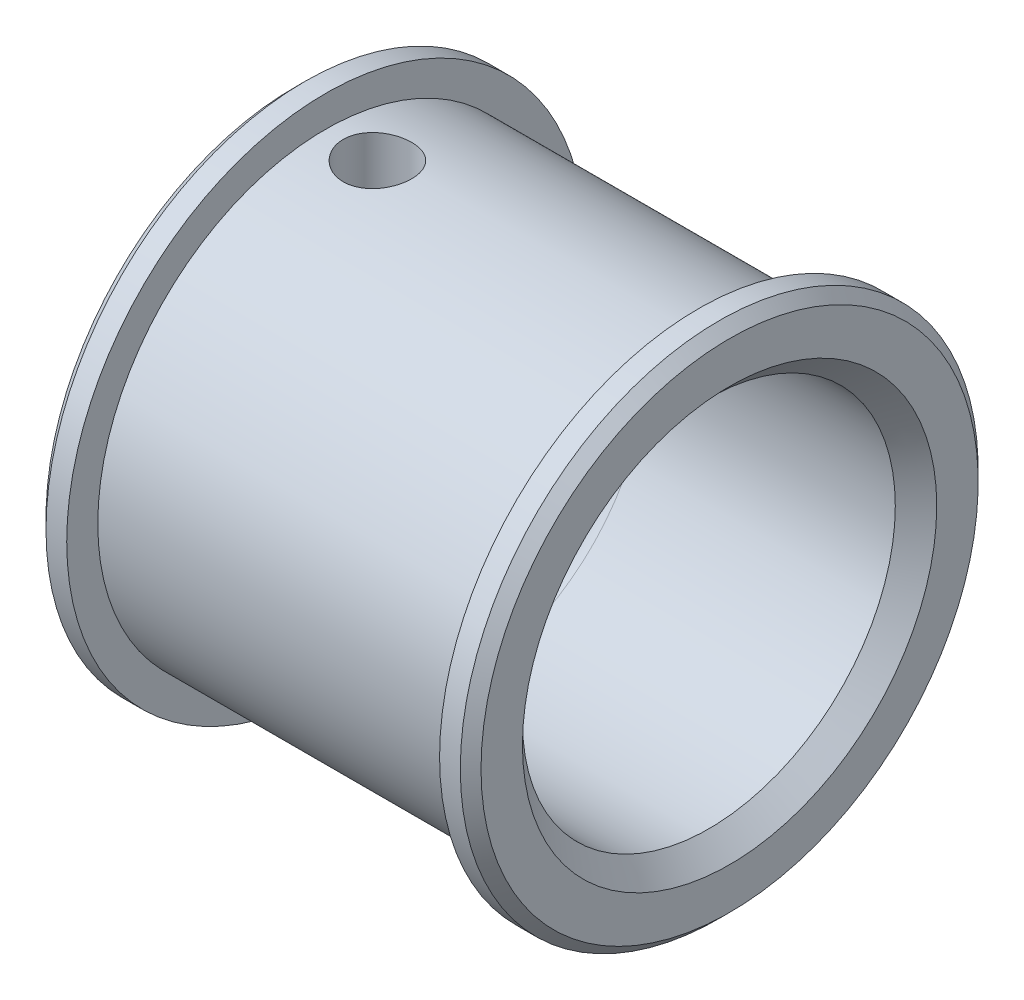
ISO-10303-21;
HEADER;
FILE_DESCRIPTION(('STEP AP214'),'2;1');
FILE_NAME('part.step','',(''),(''),'','','');
FILE_SCHEMA(('AUTOMOTIVE_DESIGN { 1 0 10303 214 1 1 1 1 }'));
ENDSEC;
DATA;
#1=APPLICATION_CONTEXT('core data for automotive mechanical design processes');
#2=APPLICATION_PROTOCOL_DEFINITION('international standard','automotive_design',2000,#1);
#3=PRODUCT_CONTEXT('',#1,'mechanical');
#4=PRODUCT('Part','Part','',(#3));
#5=PRODUCT_RELATED_PRODUCT_CATEGORY('part','',(#4));
#6=PRODUCT_DEFINITION_FORMATION('','',#4);
#7=PRODUCT_DEFINITION_CONTEXT('part definition',#1,'design');
#8=PRODUCT_DEFINITION('design','',#6,#7);
#9=PRODUCT_DEFINITION_SHAPE('','',#8);
#10=(LENGTH_UNIT() NAMED_UNIT(*) SI_UNIT(.MILLI.,.METRE.));
#11=(NAMED_UNIT(*) PLANE_ANGLE_UNIT() SI_UNIT($,.RADIAN.));
#12=(NAMED_UNIT(*) SI_UNIT($,.STERADIAN.) SOLID_ANGLE_UNIT());
#13=UNCERTAINTY_MEASURE_WITH_UNIT(LENGTH_MEASURE(1.E-05),#10,'distance_accuracy_value','');
#14=(GEOMETRIC_REPRESENTATION_CONTEXT(3) GLOBAL_UNCERTAINTY_ASSIGNED_CONTEXT((#13)) GLOBAL_UNIT_ASSIGNED_CONTEXT((#10,
#11,#12)) REPRESENTATION_CONTEXT('',''));
#15=CARTESIAN_POINT('',(0.,0.,0.));
#16=DIRECTION('',(0.,0.,1.));
#17=DIRECTION('',(1.,0.,0.));
#18=AXIS2_PLACEMENT_3D('',#15,#16,#17);
#19=CARTESIAN_POINT('',(-10.5,12.5,0.));
#20=DIRECTION('',(1.,0.,0.));
#21=DIRECTION('',(0.,0.,-1.));
#22=AXIS2_PLACEMENT_3D('',#19,#20,#21);
#23=PLANE('',#22);
#24=CARTESIAN_POINT('',(-10.5,0.,0.));
#25=DIRECTION('',(1.,0.,0.));
#26=DIRECTION('',(0.,0.,-1.));
#27=AXIS2_PLACEMENT_3D('',#24,#25,#26);
#28=CIRCLE('',#27,12.);
#29=CARTESIAN_POINT('',(-10.5,0.,-12.));
#30=VERTEX_POINT('',#29);
#31=EDGE_CURVE('E162',#30,#30,#28,.F.);
#32=ORIENTED_EDGE('',*,*,#31,.T.);
#33=EDGE_LOOP('',(#32));
#34=FACE_BOUND('',#33,.T.);
#35=CARTESIAN_POINT('',(-10.5,0.,0.));
#36=DIRECTION('',(-1.,0.,0.));
#37=DIRECTION('',(0.,0.,1.));
#38=AXIS2_PLACEMENT_3D('',#35,#36,#37);
#39=CIRCLE('',#38,1.5);
#40=CARTESIAN_POINT('',(-10.5,0.,1.5));
#41=VERTEX_POINT('',#40);
#42=EDGE_CURVE('E193',#41,#41,#39,.T.);
#43=ORIENTED_EDGE('',*,*,#42,.F.);
#44=EDGE_LOOP('',(#43));
#45=FACE_BOUND('',#44,.T.);
#46=ADVANCED_FACE('F16',(#34,#45),#23,.F.);
#47=CARTESIAN_POINT('',(-15.8306311619896,0.,0.));
#48=DIRECTION('',(-1.,0.,0.));
#49=DIRECTION('',(0.,0.,1.));
#50=AXIS2_PLACEMENT_3D('',#47,#48,#49);
#51=CYLINDRICAL_SURFACE('',#50,1.5);
#52=CARTESIAN_POINT('',(-5.81261364575664,0.,1.5));
#53=CARTESIAN_POINT('',(-5.81263332444944,0.0221484449998907,1.50000447406715));
#54=CARTESIAN_POINT('',(-5.81154216342061,0.0442761341413573,1.49950927634109));
#55=CARTESIAN_POINT('',(-5.80731407690514,0.0882309407560348,1.49756294449903));
#56=CARTESIAN_POINT('',(-5.80418304299494,0.110058739556767,1.49611456325326));
#57=CARTESIAN_POINT('',(-5.79213894012382,0.17406514586321,1.49047328028752));
#58=CARTESIAN_POINT('',(-5.78056103106485,0.215631523118339,1.48498052511109));
#59=CARTESIAN_POINT('',(-5.7452453340166,0.316953438714507,1.46744293306414));
#60=CARTESIAN_POINT('',(-5.71831774587713,0.375195737109222,1.45348605708138));
#61=CARTESIAN_POINT('',(-5.65864988415341,0.487494349877061,1.41979888355067));
#62=CARTESIAN_POINT('',(-5.62584506054334,0.541493471462896,1.40000270816456));
#63=CARTESIAN_POINT('',(-5.56188220654669,0.639336298720912,1.35783883670072));
#64=CARTESIAN_POINT('',(-5.53099961496453,0.683620767198726,1.33606556934905));
#65=CARTESIAN_POINT('',(-5.46859754913487,0.769517732585909,1.28850839632405));
#66=CARTESIAN_POINT('',(-5.4370776708278,0.811128459664325,1.26272187201679));
#67=CARTESIAN_POINT('',(-5.34316424696104,0.931855501150148,1.17948671828247));
#68=CARTESIAN_POINT('',(-5.28113143282916,1.00727266753873,1.11598629807276));
#69=CARTESIAN_POINT('',(-5.17821680199983,1.12931924692285,0.990098916855103));
#70=CARTESIAN_POINT('',(-5.13589303481992,1.17846008304906,0.931303964781121));
#71=CARTESIAN_POINT('',(-5.05729432656194,1.26861923064038,0.804150695646668));
#72=CARTESIAN_POINT('',(-5.02101128898695,1.30964842834388,0.735805408924681));
#73=CARTESIAN_POINT('',(-4.96347445044817,1.37425523156209,0.604688012192463));
#74=CARTESIAN_POINT('',(-4.94066663412035,1.39968098658133,0.543514926662855));
#75=CARTESIAN_POINT('',(-4.90201404221608,1.44261831335074,0.416346887973423));
#76=CARTESIAN_POINT('',(-4.8861646608905,1.46013512020818,0.350355158091533));
#77=CARTESIAN_POINT('',(-4.86257670412615,1.48616471401119,0.214726616012651));
#78=CARTESIAN_POINT('',(-4.85488982563047,1.494620113907,0.145069469232839));
#79=CARTESIAN_POINT('',(-4.84851747145456,1.50163145239621,0.00485236427368091));
#80=CARTESIAN_POINT('',(-4.84982867653179,1.50019104138851,-0.0657072514139795));
#81=CARTESIAN_POINT('',(-4.86072191383893,1.48819943697544,-0.198055856544781));
#82=CARTESIAN_POINT('',(-4.86944850680373,1.47859051716961,-0.260006547660198));
#83=CARTESIAN_POINT('',(-4.89340859236543,1.45212512243361,-0.381012828513425));
#84=CARTESIAN_POINT('',(-4.9086433349569,1.43526725522268,-0.440067859663008));
#85=CARTESIAN_POINT('',(-4.94558272145756,1.39420159043156,-0.556985503150736));
#86=CARTESIAN_POINT('',(-4.96757157750177,1.36966981058903,-0.614642568564465));
#87=CARTESIAN_POINT('',(-5.01648080586363,1.31471839277816,-0.724782673881045));
#88=CARTESIAN_POINT('',(-5.04340318613218,1.28429635718163,-0.777263593659041));
#89=CARTESIAN_POINT('',(-5.1162317756353,1.20121185017075,-0.902985502421483));
#90=CARTESIAN_POINT('',(-5.16466961182815,1.1452732795972,-0.972607311476642));
#91=CARTESIAN_POINT('',(-5.26677976583923,1.02439312474697,-1.09923918777515));
#92=CARTESIAN_POINT('',(-5.32046906968799,0.95942201849418,-1.1562062400392));
#93=CARTESIAN_POINT('',(-5.43087630999232,0.820030708328009,-1.25906875302783));
#94=CARTESIAN_POINT('',(-5.48763609854247,0.745419859685906,-1.30466286148348));
#95=CARTESIAN_POINT('',(-5.57003302171161,0.626989417453348,-1.36338214886629));
#96=CARTESIAN_POINT('',(-5.59702901112282,0.586448311247488,-1.38133684919243));
#97=CARTESIAN_POINT('',(-5.64897250092498,0.502822395260097,-1.41392509255887));
#98=CARTESIAN_POINT('',(-5.67392252580562,0.459740836545143,-1.42856276901354));
#99=CARTESIAN_POINT('',(-5.71766438687963,0.37512927823825,-1.45293241521923));
#100=CARTESIAN_POINT('',(-5.73682569909761,0.333895642009347,-1.46301415456402));
#101=CARTESIAN_POINT('',(-5.7699619061568,0.248928057972136,-1.47982745388688));
#102=CARTESIAN_POINT('',(-5.78397025059878,0.205212441634933,-1.48658072104476));
#103=CARTESIAN_POINT('',(-5.80006996711576,0.134320181687053,-1.49420358558965));
#104=CARTESIAN_POINT('',(-5.80469497204194,0.107861991820303,-1.49635252195317));
#105=CARTESIAN_POINT('',(-5.81100289706566,0.0542883536749681,-1.49926218434104));
#106=CARTESIAN_POINT('',(-5.81265917440118,0.0271691459158347,-1.50001034175024));
#107=CARTESIAN_POINT('',(-5.81261364575664,0.,-1.5));
#108=B_SPLINE_CURVE_WITH_KNOTS('',3,(#52,#53,#54,#55,#56,#57,#58,#59,#60,#61,#62,#63,#64,#65,
#66,#67,#68,#69,#70,#71,#72,#73,#74,#75,#76,#77,#78,#79,#80,#81,#82,#83,#84,#85,#86,#87,#88,#89,
#90,#91,#92,#93,#94,#95,#96,#97,#98,#99,#100,#101,#102,#103,#104,#105,#106,#107),.UNSPECIFIED.,
.F.,.F.,(4,2,2,2,2,2,2,2,2,2,2,2,2,2,2,2,2,2,2,2,2,2,2,2,2,2,2,4),(0.,0.06637800265653,
0.132565136709904,0.262391568285188,0.458312912660749,0.656535147557365,0.830949570164951,
1.00547827832983,1.35297301132437,1.61471771431487,1.87610872160454,2.08546425100029,
2.29468099946101,2.50521505325031,2.7156714487245,2.90470632319764,3.0937775211868,
3.29225659457519,3.49081662935398,3.7939273115488,4.09805305096362,4.40953989932393,
4.56513131068288,4.7205277568222,4.85993701945224,4.99842465742858,5.07906895311344,
5.16043343232562),.UNSPECIFIED.);
#109=CARTESIAN_POINT('',(-5.81261364575663,0.,1.5));
#110=VERTEX_POINT('',#109);
#111=CARTESIAN_POINT('',(-5.81261364575663,0.,-1.5));
#112=VERTEX_POINT('',#111);
#113=EDGE_CURVE('E57',#110,#112,#108,.T.);
#114=ORIENTED_EDGE('',*,*,#113,.T.);
#115=CARTESIAN_POINT('',(-5.47272096727017,0.099342002139551,-1.49670677375727));
#116=CARTESIAN_POINT('',(-5.55195628237137,0.0733160442846707,-1.49846138718336));
#117=CARTESIAN_POINT('',(-5.63178071175657,0.0487658039922867,-1.49937913836414));
#118=CARTESIAN_POINT('',(-5.79307391920479,0.00408727440559884,-1.50015522131082));
#119=CARTESIAN_POINT('',(-5.87454887184842,-0.0160185740532772,-1.50000829777071));
#120=CARTESIAN_POINT('',(-6.03621952216187,-0.0495089156705912,-1.49927593705374));
#121=CARTESIAN_POINT('',(-6.11637368367455,-0.0630865727855815,-1.49870457316831));
#122=CARTESIAN_POINT('',(-6.27742452717063,-0.0828301995331259,-1.4977447060977));
#123=CARTESIAN_POINT('',(-6.35831887758854,-0.0890144481803957,-1.49735575338465));
#124=CARTESIAN_POINT('',(-6.53009705543598,-0.0933367156437068,-1.49709739232028));
#125=CARTESIAN_POINT('',(-6.62101078119259,-0.0904161424478711,-1.49729618688302));
#126=CARTESIAN_POINT('',(-6.80219068914342,-0.0747002910280119,-1.498156451644));
#127=CARTESIAN_POINT('',(-6.8924541703561,-0.0618759115762149,-1.49881928483044));
#128=CARTESIAN_POINT('',(-7.07472898600546,-0.0277866782560279,-1.49984049101366));
#129=CARTESIAN_POINT('',(-7.16668379753452,-0.00623073003471671,-1.50018686334292));
#130=CARTESIAN_POINT('',(-7.30311343418561,0.0304975066292785,-1.49973994287834));
#131=CARTESIAN_POINT('',(-7.34821918113973,0.04343164609386,-1.49943202217326));
#132=CARTESIAN_POINT('',(-7.43803223678071,0.0705259326607055,-1.49840280870264));
#133=CARTESIAN_POINT('',(-7.4827397358394,0.0846854549998855,-1.49768172554665));
#134=CARTESIAN_POINT('',(-7.52727903273141,0.0993420021400711,-1.49670677375724));
#135=B_SPLINE_CURVE_WITH_KNOTS('',3,(#115,#116,#117,#118,#119,#120,#121,#122,#123,#124,#125,
#126,#127,#128,#129,#130,#131,#132,#133,#134),.UNSPECIFIED.,.F.,.F.,(4,2,2,2,2,2,2,2,2,4),(0.,
0.250363583291111,0.501963816864104,0.745574408540324,0.988581458335004,1.26085109525064,
1.53392382441083,1.81696743144345,1.95772743340833,2.09841608680726),.UNSPECIFIED.);
#136=CARTESIAN_POINT('',(-7.18738635424337,0.,-1.5));
#137=VERTEX_POINT('',#136);
#138=EDGE_CURVE('E10',#112,#137,#135,.T.);
#139=ORIENTED_EDGE('',*,*,#138,.T.);
#140=CARTESIAN_POINT('',(-7.18738635424336,0.,-1.5));
#141=CARTESIAN_POINT('',(-7.18736667555056,0.0221484449998907,-1.50000447406715));
#142=CARTESIAN_POINT('',(-7.18845783657939,0.0442761341413573,-1.49950927634109));
#143=CARTESIAN_POINT('',(-7.19268592309486,0.0882309407560348,-1.49756294449903));
#144=CARTESIAN_POINT('',(-7.19581695700506,0.110058739556767,-1.49611456325326));
#145=CARTESIAN_POINT('',(-7.20786105987618,0.17406514586321,-1.49047328028752));
#146=CARTESIAN_POINT('',(-7.21943896893515,0.21563152311834,-1.48498052511109));
#147=CARTESIAN_POINT('',(-7.2547546659834,0.316953438714508,-1.46744293306414));
#148=CARTESIAN_POINT('',(-7.28168225412287,0.375195737109223,-1.45348605708138));
#149=CARTESIAN_POINT('',(-7.34135011584659,0.487494349877062,-1.41979888355067));
#150=CARTESIAN_POINT('',(-7.37415493945666,0.541493471462898,-1.40000270816456));
#151=CARTESIAN_POINT('',(-7.43811779345331,0.639336298720915,-1.35783883670072));
#152=CARTESIAN_POINT('',(-7.46900038503547,0.683620767198729,-1.33606556934905));
#153=CARTESIAN_POINT('',(-7.53140245086513,0.769517732585911,-1.28850839632405));
#154=CARTESIAN_POINT('',(-7.5629223291722,0.811128459664326,-1.26272187201679));
#155=CARTESIAN_POINT('',(-7.65683575303896,0.93185550115015,-1.17948671828247));
#156=CARTESIAN_POINT('',(-7.71886856717084,1.00727266753873,-1.11598629807275));
#157=CARTESIAN_POINT('',(-7.82178319800017,1.12931924692285,-0.990098916855102));
#158=CARTESIAN_POINT('',(-7.86410696518008,1.17846008304906,-0.93130396478112));
#159=CARTESIAN_POINT('',(-7.94270567343806,1.26861923064038,-0.804150695646667));
#160=CARTESIAN_POINT('',(-7.97898871101305,1.30964842834388,-0.735805408924681));
#161=CARTESIAN_POINT('',(-8.03652554955183,1.37425523156209,-0.604688012192463));
#162=CARTESIAN_POINT('',(-8.05933336587965,1.39968098658133,-0.543514926662855));
#163=CARTESIAN_POINT('',(-8.09798595778392,1.44261831335074,-0.416346887973423));
#164=CARTESIAN_POINT('',(-8.1138353391095,1.46013512020818,-0.350355158091534));
#165=CARTESIAN_POINT('',(-8.13742329587386,1.48616471401119,-0.214726616012652));
#166=CARTESIAN_POINT('',(-8.14511017436953,1.494620113907,-0.145069469232839));
#167=CARTESIAN_POINT('',(-8.15148252854544,1.50163145239621,-0.00485236427368121));
#168=CARTESIAN_POINT('',(-8.15017132346821,1.50019104138851,0.0657072514139789));
#169=CARTESIAN_POINT('',(-8.13927808616107,1.48819943697544,0.198055856544781));
#170=CARTESIAN_POINT('',(-8.13055149319628,1.47859051716961,0.260006547660199));
#171=CARTESIAN_POINT('',(-8.10659140763457,1.45212512243361,0.381012828513426));
#172=CARTESIAN_POINT('',(-8.09135666504309,1.43526725522268,0.440067859663007));
#173=CARTESIAN_POINT('',(-8.05441727854243,1.39420159043156,0.556985503150736));
#174=CARTESIAN_POINT('',(-8.03242842249822,1.36966981058903,0.614642568564467));
#175=CARTESIAN_POINT('',(-7.98351919413637,1.31471839277816,0.724782673881047));
#176=CARTESIAN_POINT('',(-7.95659681386782,1.28429635718163,0.777263593659042));
#177=CARTESIAN_POINT('',(-7.8837682243647,1.20121185017075,0.902985502421482));
#178=CARTESIAN_POINT('',(-7.83533038817185,1.1452732795972,0.972607311476641));
#179=CARTESIAN_POINT('',(-7.73322023416077,1.02439312474697,1.09923918777515));
#180=CARTESIAN_POINT('',(-7.67953093031201,0.959422018494182,1.1562062400392));
#181=CARTESIAN_POINT('',(-7.56912369000768,0.82003070832801,1.25906875302783));
#182=CARTESIAN_POINT('',(-7.51236390145753,0.745419859685907,1.30466286148348));
#183=CARTESIAN_POINT('',(-7.42996697828839,0.62698941745335,1.36338214886629));
#184=CARTESIAN_POINT('',(-7.40297098887718,0.58644831124749,1.38133684919242));
#185=CARTESIAN_POINT('',(-7.35102749907502,0.502822395260099,1.41392509255887));
#186=CARTESIAN_POINT('',(-7.32607747419438,0.459740836545143,1.42856276901354));
#187=CARTESIAN_POINT('',(-7.28233561312037,0.375129278238251,1.45293241521923));
#188=CARTESIAN_POINT('',(-7.26317430090239,0.333895642009349,1.46301415456402));
#189=CARTESIAN_POINT('',(-7.2300380938432,0.248928057972138,1.47982745388688));
#190=CARTESIAN_POINT('',(-7.21602974940122,0.205212441634935,1.48658072104476));
#191=CARTESIAN_POINT('',(-7.19993003288424,0.134320181687054,1.49420358558965));
#192=CARTESIAN_POINT('',(-7.19530502795806,0.107861991820304,1.49635252195317));
#193=CARTESIAN_POINT('',(-7.18899710293434,0.0542883536749683,1.49926218434104));
#194=CARTESIAN_POINT('',(-7.18734082559882,0.0271691459158349,1.50001034175024));
#195=CARTESIAN_POINT('',(-7.18738635424336,0.,1.5));
#196=B_SPLINE_CURVE_WITH_KNOTS('',3,(#140,#141,#142,#143,#144,#145,#146,#147,#148,#149,#150,
#151,#152,#153,#154,#155,#156,#157,#158,#159,#160,#161,#162,#163,#164,#165,#166,#167,#168,#169,
#170,#171,#172,#173,#174,#175,#176,#177,#178,#179,#180,#181,#182,#183,#184,#185,#186,#187,#188,
#189,#190,#191,#192,#193,#194,#195),.UNSPECIFIED.,.F.,.F.,(4,2,2,2,2,2,2,2,2,2,2,2,2,2,2,2,2,2,
2,2,2,2,2,2,2,2,2,4),(0.,0.0663780026565299,0.132565136709904,0.262391568285189,
0.45831291266075,0.656535147557367,0.830949570164954,1.00547827832983,1.35297301132437,
1.61471771431487,1.87610872160454,2.08546425100028,2.29468099946101,2.50521505325031,
2.7156714487245,2.90470632319764,3.0937775211868,3.29225659457519,3.49081662935398,
3.7939273115488,4.09805305096361,4.40953989932393,4.56513131068288,4.7205277568222,
4.85993701945223,4.99842465742858,5.07906895311344,5.16043343232562),.UNSPECIFIED.);
#197=CARTESIAN_POINT('',(-7.18738635424337,0.,1.5));
#198=VERTEX_POINT('',#197);
#199=EDGE_CURVE('E30',#137,#198,#196,.T.);
#200=ORIENTED_EDGE('',*,*,#199,.T.);
#201=CARTESIAN_POINT('',(-7.52727903273141,0.0993420021400713,1.49670677375724));
#202=CARTESIAN_POINT('',(-7.44804371763018,0.073316044285158,1.49846138718334));
#203=CARTESIAN_POINT('',(-7.36821928824495,0.0487658039927383,1.49937913836412));
#204=CARTESIAN_POINT('',(-7.20692608079667,0.00408727440597363,1.50015522131082));
#205=CARTESIAN_POINT('',(-7.12545112815301,-0.0160185740529433,1.50000829777072));
#206=CARTESIAN_POINT('',(-6.9637804778395,-0.0495089156703421,1.49927593705375));
#207=CARTESIAN_POINT('',(-6.88362631632679,-0.0630865727853761,1.49870457316832));
#208=CARTESIAN_POINT('',(-6.72257547283065,-0.0828301995330087,1.49774470609771));
#209=CARTESIAN_POINT('',(-6.64168112241271,-0.0890144481803229,1.49735575338465));
#210=CARTESIAN_POINT('',(-6.46990294456527,-0.0933367156437202,1.49709739232028));
#211=CARTESIAN_POINT('',(-6.37898921880869,-0.0904161424479344,1.49729618688302));
#212=CARTESIAN_POINT('',(-6.19780931085792,-0.0747002910281756,1.49815645164399));
#213=CARTESIAN_POINT('',(-6.10754582964527,-0.0618759115764291,1.49881928483043));
#214=CARTESIAN_POINT('',(-5.92527101399598,-0.0277866782563394,1.49984049101365));
#215=CARTESIAN_POINT('',(-5.83331620246694,-0.00623073003507504,1.50018686334292));
#216=CARTESIAN_POINT('',(-5.69688656581589,0.0304975066288552,1.49973994287835));
#217=CARTESIAN_POINT('',(-5.6517808188618,0.0434316460934161,1.49943202217327));
#218=CARTESIAN_POINT('',(-5.56196776322084,0.0705259326602223,1.49840280870266));
#219=CARTESIAN_POINT('',(-5.51726026416216,0.0846854549993837,1.49768172554667));
#220=CARTESIAN_POINT('',(-5.47272096727017,0.0993420021395515,1.49670677375727));
#221=B_SPLINE_CURVE_WITH_KNOTS('',3,(#201,#202,#203,#204,#205,#206,#207,#208,#209,#210,#211,
#212,#213,#214,#215,#216,#217,#218,#219,#220),.UNSPECIFIED.,.F.,.F.,(4,2,2,2,2,2,2,2,2,4),(0.,
0.250363583291228,0.501963816864339,0.745574408540668,0.988581458335458,1.26085109525099,
1.53392382441107,1.81696743144357,1.95772743340839,2.09841608680726),.UNSPECIFIED.);
#222=EDGE_CURVE('E40',#198,#110,#221,.T.);
#223=ORIENTED_EDGE('',*,*,#222,.T.);
#224=EDGE_LOOP('',(#114,#139,#200,#223));
#225=FACE_BOUND('',#224,.T.);
#226=CARTESIAN_POINT('',(-3.5,0.,0.));
#227=DIRECTION('',(-1.,0.,0.));
#228=DIRECTION('',(0.,0.,1.));
#229=AXIS2_PLACEMENT_3D('',#226,#227,#228);
#230=CIRCLE('',#229,1.5);
#231=CARTESIAN_POINT('',(-3.5,0.,1.5));
#232=VERTEX_POINT('',#231);
#233=EDGE_CURVE('E190',#232,#232,#230,.T.);
#234=ORIENTED_EDGE('',*,*,#233,.F.);
#235=EDGE_LOOP('',(#234));
#236=FACE_BOUND('',#235,.T.);
#237=ORIENTED_EDGE('',*,*,#42,.T.);
#238=EDGE_LOOP('',(#237));
#239=FACE_BOUND('',#238,.T.);
#240=ADVANCED_FACE('F60',(#225,#236,#239),#51,.F.);
#241=CARTESIAN_POINT('',(-3.5,9.,0.));
#242=DIRECTION('',(-1.,0.,0.));
#243=DIRECTION('',(0.,0.,1.));
#244=AXIS2_PLACEMENT_3D('',#241,#242,#243);
#245=PLANE('',#244);
#246=CARTESIAN_POINT('',(-3.5,0.,0.));
#247=DIRECTION('',(-1.,0.,0.));
#248=DIRECTION('',(0.,0.,1.));
#249=AXIS2_PLACEMENT_3D('',#246,#247,#248);
#250=CIRCLE('',#249,8.);
#251=CARTESIAN_POINT('',(-3.5,0.,8.));
#252=VERTEX_POINT('',#251);
#253=EDGE_CURVE('E199',#252,#252,#250,.F.);
#254=ORIENTED_EDGE('',*,*,#253,.T.);
#255=EDGE_LOOP('',(#254));
#256=FACE_BOUND('',#255,.T.);
#257=ORIENTED_EDGE('',*,*,#233,.T.);
#258=EDGE_LOOP('',(#257));
#259=FACE_BOUND('',#258,.T.);
#260=ADVANCED_FACE('F118',(#256,#259),#245,.F.);
#261=CARTESIAN_POINT('',(-15.8306311619896,0.,0.));
#262=DIRECTION('',(-1.,0.,0.));
#263=DIRECTION('',(0.,0.,1.));
#264=AXIS2_PLACEMENT_3D('',#261,#262,#263);
#265=CYLINDRICAL_SURFACE('',#264,9.);
#266=CARTESIAN_POINT('',(9.5,0.,0.));
#267=DIRECTION('',(-1.,0.,0.));
#268=DIRECTION('',(0.,0.,1.));
#269=AXIS2_PLACEMENT_3D('',#266,#267,#268);
#270=CIRCLE('',#269,9.);
#271=CARTESIAN_POINT('',(9.5,0.,9.));
#272=VERTEX_POINT('',#271);
#273=EDGE_CURVE('E160',#272,#272,#270,.F.);
#274=ORIENTED_EDGE('',*,*,#273,.T.);
#275=EDGE_LOOP('',(#274));
#276=FACE_BOUND('',#275,.T.);
#277=CARTESIAN_POINT('',(-2.5,0.,0.));
#278=DIRECTION('',(-1.,0.,0.));
#279=DIRECTION('',(0.,0.,1.));
#280=AXIS2_PLACEMENT_3D('',#277,#278,#279);
#281=CIRCLE('',#280,9.);
#282=CARTESIAN_POINT('',(-2.5,0.,9.));
#283=VERTEX_POINT('',#282);
#284=EDGE_CURVE('E196',#283,#283,#281,.T.);
#285=ORIENTED_EDGE('',*,*,#284,.T.);
#286=EDGE_LOOP('',(#285));
#287=FACE_BOUND('',#286,.T.);
#288=ADVANCED_FACE('F115',(#276,#287),#265,.F.);
#289=CARTESIAN_POINT('',(10.5,12.5,0.));
#290=DIRECTION('',(-1.,0.,0.));
#291=DIRECTION('',(0.,0.,1.));
#292=AXIS2_PLACEMENT_3D('',#289,#290,#291);
#293=PLANE('',#292);
#294=CARTESIAN_POINT('',(10.5,0.,0.));
#295=DIRECTION('',(-1.,0.,0.));
#296=DIRECTION('',(0.,0.,1.));
#297=AXIS2_PLACEMENT_3D('',#294,#295,#296);
#298=CIRCLE('',#297,12.);
#299=CARTESIAN_POINT('',(10.5,0.,12.));
#300=VERTEX_POINT('',#299);
#301=EDGE_CURVE('E156',#300,#300,#298,.F.);
#302=ORIENTED_EDGE('',*,*,#301,.T.);
#303=EDGE_LOOP('',(#302));
#304=FACE_BOUND('',#303,.T.);
#305=CARTESIAN_POINT('',(10.5,0.,0.));
#306=DIRECTION('',(-1.,0.,0.));
#307=DIRECTION('',(0.,0.,1.));
#308=AXIS2_PLACEMENT_3D('',#305,#306,#307);
#309=CIRCLE('',#308,10.);
#310=CARTESIAN_POINT('',(10.5,0.,10.));
#311=VERTEX_POINT('',#310);
#312=EDGE_CURVE('E165',#311,#311,#309,.T.);
#313=ORIENTED_EDGE('',*,*,#312,.T.);
#314=EDGE_LOOP('',(#313));
#315=FACE_BOUND('',#314,.T.);
#316=ADVANCED_FACE('F111',(#304,#315),#293,.F.);
#317=CARTESIAN_POINT('',(-15.8306311619896,0.,0.));
#318=DIRECTION('',(-1.,0.,0.));
#319=DIRECTION('',(0.,0.,1.));
#320=AXIS2_PLACEMENT_3D('',#317,#318,#319);
#321=CYLINDRICAL_SURFACE('',#320,12.5);
#322=CARTESIAN_POINT('',(10.,0.,0.));
#323=DIRECTION('',(-1.,0.,0.));
#324=DIRECTION('',(0.,0.,1.));
#325=AXIS2_PLACEMENT_3D('',#322,#323,#324);
#326=CIRCLE('',#325,12.5);
#327=CARTESIAN_POINT('',(10.,0.,12.5));
#328=VERTEX_POINT('',#327);
#329=EDGE_CURVE('E159',#328,#328,#326,.T.);
#330=ORIENTED_EDGE('',*,*,#329,.T.);
#331=EDGE_LOOP('',(#330));
#332=FACE_BOUND('',#331,.T.);
#333=CARTESIAN_POINT('',(9.,0.,0.));
#334=DIRECTION('',(-1.,0.,0.));
#335=DIRECTION('',(0.,0.,1.));
#336=AXIS2_PLACEMENT_3D('',#333,#334,#335);
#337=CIRCLE('',#336,12.5);
#338=CARTESIAN_POINT('',(9.,0.,12.5));
#339=VERTEX_POINT('',#338);
#340=EDGE_CURVE('E185',#339,#339,#337,.T.);
#341=ORIENTED_EDGE('',*,*,#340,.F.);
#342=EDGE_LOOP('',(#341));
#343=FACE_BOUND('',#342,.T.);
#344=ADVANCED_FACE('F107',(#332,#343),#321,.T.);
#345=CARTESIAN_POINT('',(9.,11.,0.));
#346=DIRECTION('',(1.,0.,0.));
#347=DIRECTION('',(0.,0.,-1.));
#348=AXIS2_PLACEMENT_3D('',#345,#346,#347);
#349=PLANE('',#348);
#350=CARTESIAN_POINT('',(9.,0.,0.));
#351=DIRECTION('',(-1.,0.,0.));
#352=DIRECTION('',(0.,0.,1.));
#353=AXIS2_PLACEMENT_3D('',#350,#351,#352);
#354=CIRCLE('',#353,11.);
#355=CARTESIAN_POINT('',(9.,0.,11.));
#356=VERTEX_POINT('',#355);
#357=EDGE_CURVE('E181',#356,#356,#354,.T.);
#358=ORIENTED_EDGE('',*,*,#357,.F.);
#359=EDGE_LOOP('',(#358));
#360=FACE_BOUND('',#359,.T.);
#361=ORIENTED_EDGE('',*,*,#340,.T.);
#362=EDGE_LOOP('',(#361));
#363=FACE_BOUND('',#362,.T.);
#364=ADVANCED_FACE('F103',(#360,#363),#349,.F.);
#365=CARTESIAN_POINT('',(-15.8306311619896,0.,0.));
#366=DIRECTION('',(-1.,0.,0.));
#367=DIRECTION('',(0.,0.,1.));
#368=AXIS2_PLACEMENT_3D('',#365,#366,#367);
#369=CYLINDRICAL_SURFACE('',#368,11.);
#370=CARTESIAN_POINT('',(-6.5,10.8755459633069,1.65));
#371=CARTESIAN_POINT('',(-6.59212012621895,10.8755475033545,1.64999619518013));
#372=CARTESIAN_POINT('',(-6.68429372582578,10.8767290691301,1.6422592602734));
#373=CARTESIAN_POINT('',(-6.86606384637144,10.8813244628356,1.61152416322701));
#374=CARTESIAN_POINT('',(-6.95565776462801,10.8847404680457,1.5885111154289));
#375=CARTESIAN_POINT('',(-7.12961113099159,10.8934093288485,1.52792778707892));
#376=CARTESIAN_POINT('',(-7.21397453879637,10.8986607744469,1.49036867849537));
#377=CARTESIAN_POINT('',(-7.37518973384929,10.9104071352446,1.4017856939657));
#378=CARTESIAN_POINT('',(-7.45204255323572,10.9169018792203,1.35076367172858));
#379=CARTESIAN_POINT('',(-7.59668219842976,10.9304611817284,1.23626692660414));
#380=CARTESIAN_POINT('',(-7.66440017474741,10.9375294870386,1.17270566143302));
#381=CARTESIAN_POINT('',(-7.78825123422105,10.9514060498595,1.03512156598881));
#382=CARTESIAN_POINT('',(-7.84438368038369,10.9582142930548,0.961098160865181));
#383=CARTESIAN_POINT('',(-7.9437242948605,10.97084282171,0.804249993858017));
#384=CARTESIAN_POINT('',(-7.98686906535471,10.9766582027913,0.721384650102343));
#385=CARTESIAN_POINT('',(-8.05860275868899,10.9866042742105,0.549481735117672));
#386=CARTESIAN_POINT('',(-8.08719245062717,10.9907350535614,0.460444490297743));
#387=CARTESIAN_POINT('',(-8.12879572738392,10.9968200627756,0.279434235399624));
#388=CARTESIAN_POINT('',(-8.14192459902588,10.9987903947608,0.187488272828852));
#389=CARTESIAN_POINT('',(-8.15259152830738,11.0003876924654,0.00267872442142729));
#390=CARTESIAN_POINT('',(-8.15013045265165,11.0000147884543,-0.0901848101173201));
#391=CARTESIAN_POINT('',(-8.12977832846132,10.9969804962687,-0.273406890020572));
#392=CARTESIAN_POINT('',(-8.11201131102937,10.9943375041773,-0.36377956054001));
#393=CARTESIAN_POINT('',(-8.06174633304517,10.9870805025064,-0.540246112057451));
#394=CARTESIAN_POINT('',(-8.02924799334841,10.9824664421971,-0.626339882864827));
#395=CARTESIAN_POINT('',(-7.95031590339118,10.9717541326053,-0.792180158847346));
#396=CARTESIAN_POINT('',(-7.90382993838038,10.965650338672,-0.871901439555957));
#397=CARTESIAN_POINT('',(-7.79828028696302,10.9526388206996,-1.0224586978652));
#398=CARTESIAN_POINT('',(-7.73921577262244,10.945731043755,-1.0932940900989));
#399=CARTESIAN_POINT('',(-7.60949470629075,10.9318017401189,-1.22479993099491));
#400=CARTESIAN_POINT('',(-7.53872986583288,10.9247797628558,-1.28536356246041));
#401=CARTESIAN_POINT('',(-7.38798481516389,10.9114797489888,-1.39377259272694));
#402=CARTESIAN_POINT('',(-7.30800454820808,10.9052017169661,-1.44161791320798));
#403=CARTESIAN_POINT('',(-7.14098764076529,10.8941005281554,-1.52324660988065));
#404=CARTESIAN_POINT('',(-7.05394555297137,10.8892785082982,-1.5570190049709));
#405=CARTESIAN_POINT('',(-6.87533621933787,10.8816554318896,-1.60943569829767));
#406=CARTESIAN_POINT('',(-6.78376929289857,10.8788542329093,-1.62808106271058));
#407=CARTESIAN_POINT('',(-6.59965990146476,10.8756169653453,-1.6495679209532));
#408=CARTESIAN_POINT('',(-6.50713549297831,10.8751582368283,-1.65256083591557));
#409=CARTESIAN_POINT('',(-6.32290638570093,10.8765976873087,-1.64305962721801));
#410=CARTESIAN_POINT('',(-6.23120166156416,10.8784957931736,-1.63056598410532));
#411=CARTESIAN_POINT('',(-6.0516842002378,10.884414227076,-1.59057473248042));
#412=CARTESIAN_POINT('',(-5.96385427456423,10.8884238813114,-1.56315256380603));
#413=CARTESIAN_POINT('',(-5.79403749874653,10.8981048200834,-1.49416115141795));
#414=CARTESIAN_POINT('',(-5.71205093740898,10.9037761866789,-1.45259120904027));
#415=CARTESIAN_POINT('',(-5.55556941363145,10.9161949125577,-1.35612045794855));
#416=CARTESIAN_POINT('',(-5.4811355079922,10.9229500520799,-1.30112163017943));
#417=CARTESIAN_POINT('',(-5.34249985413881,10.9367517537669,-1.17949058520921));
#418=CARTESIAN_POINT('',(-5.27829868490074,10.9437983323932,-1.11285771019147));
#419=CARTESIAN_POINT('',(-5.16140713270306,10.9574597573912,-0.969183181590997));
#420=CARTESIAN_POINT('',(-5.10881709893328,10.9640705180646,-0.892059439449152));
#421=CARTESIAN_POINT('',(-5.0173398042111,10.9760519553522,-0.729984288290049));
#422=CARTESIAN_POINT('',(-4.97845216838847,10.9814226658902,-0.64503309349648));
#423=CARTESIAN_POINT('',(-4.91564388326317,10.9903009662687,-0.470027795447259));
#424=CARTESIAN_POINT('',(-4.8916683662138,10.9938153788969,-0.379993744629732));
#425=CARTESIAN_POINT('',(-4.85918733250878,10.9986137432259,-0.197120897051313));
#426=CARTESIAN_POINT('',(-4.85068079412595,10.9998978422388,-0.104282285943639));
#427=CARTESIAN_POINT('',(-4.84940412499566,11.0000894196506,0.0805910499469015));
#428=CARTESIAN_POINT('',(-4.85648045103533,10.9990200872618,0.172624727233259));
#429=CARTESIAN_POINT('',(-4.88583952726283,10.9946717157105,0.354177774855418));
#430=CARTESIAN_POINT('',(-4.90812222878942,10.9913926836193,0.443697153236162));
#431=CARTESIAN_POINT('',(-4.96720706312727,10.9829916541671,0.617638311817626));
#432=CARTESIAN_POINT('',(-5.00399856465283,10.9778710064864,0.702063772463663));
#433=CARTESIAN_POINT('',(-5.09104023678146,10.9663491794505,0.863567229686264));
#434=CARTESIAN_POINT('',(-5.14129084432838,10.9599479585237,0.940644987612776));
#435=CARTESIAN_POINT('',(-5.2543794687121,10.946501616998,1.08604384371115));
#436=CARTESIAN_POINT('',(-5.31733084839798,10.9394510326854,1.15427627309102));
#437=CARTESIAN_POINT('',(-5.45379558038852,10.925541018579,1.27926489229295));
#438=CARTESIAN_POINT('',(-5.52731140820678,10.9186816340392,1.33601838478882));
#439=CARTESIAN_POINT('',(-5.68330388155579,10.9058893243203,1.43672441905271));
#440=CARTESIAN_POINT('',(-5.76582855872401,10.8999618217268,1.4806032372033));
#441=CARTESIAN_POINT('',(-5.93712645443963,10.889768000218,1.55381175259249));
#442=CARTESIAN_POINT('',(-6.02589307864361,10.8854999583872,1.58315654832386));
#443=CARTESIAN_POINT('',(-6.17921517988213,10.8800943407731,1.61980447079028));
#444=CARTESIAN_POINT('',(-6.2428237366167,10.8783977432062,1.63111046758462));
#445=CARTESIAN_POINT('',(-6.37094612090779,10.8761230222371,1.64620951634232));
#446=CARTESIAN_POINT('',(-6.43545993671957,10.8755448843377,1.65000266568583));
#447=CARTESIAN_POINT('',(-6.5,10.8755459633069,1.65));
#448=B_SPLINE_CURVE_WITH_KNOTS('',3,(#370,#371,#372,#373,#374,#375,#376,#377,#378,#379,#380,
#381,#382,#383,#384,#385,#386,#387,#388,#389,#390,#391,#392,#393,#394,#395,#396,#397,#398,#399,
#400,#401,#402,#403,#404,#405,#406,#407,#408,#409,#410,#411,#412,#413,#414,#415,#416,#417,#418,
#419,#420,#421,#422,#423,#424,#425,#426,#427,#428,#429,#430,#431,#432,#433,#434,#435,#436,#437,
#438,#439,#440,#441,#442,#443,#444,#445,#446,#447),.UNSPECIFIED.,.T.,.F.,(4,2,2,2,2,2,2,2,2,2,2,
2,2,2,2,2,2,2,2,2,2,2,2,2,2,2,2,2,2,2,2,2,2,2,2,2,2,2,4),(0.,0.276124476985355,
0.552518416517985,0.828700493869239,1.10484456352745,1.38296574514018,1.66110221428599,
1.9405751431636,2.2200333030095,2.49739415787836,2.77473959333311,3.049858487673,
3.32498446323341,3.60115048025098,3.87733468044198,4.15623499132895,4.43513701965784,
4.71425626950451,4.99335584488774,5.26975036064117,5.54613630009909,5.82113834288111,
6.09615396814728,6.37324034601431,6.65034239607981,6.92975291528866,7.20915578979038,
7.48752444980197,7.76587472287519,8.04149459984558,8.31711359482104,8.59253100483615,
8.86795735723815,9.14596045012064,9.42402879260546,9.70365966707422,9.98299943790118,
10.1764568608077,10.3699117761381),.UNSPECIFIED.);
#449=CARTESIAN_POINT('',(-6.5,10.8755459633069,1.65));
#450=VERTEX_POINT('',#449);
#451=EDGE_CURVE('E58',#450,#450,#448,.T.);
#452=ORIENTED_EDGE('',*,*,#451,.T.);
#453=EDGE_LOOP('',(#452));
#454=FACE_BOUND('',#453,.T.);
#455=CARTESIAN_POINT('',(-9.,0.,0.));
#456=DIRECTION('',(-1.,0.,0.));
#457=DIRECTION('',(0.,0.,1.));
#458=AXIS2_PLACEMENT_3D('',#455,#456,#457);
#459=CIRCLE('',#458,11.);
#460=CARTESIAN_POINT('',(-9.,0.,11.));
#461=VERTEX_POINT('',#460);
#462=EDGE_CURVE('E179',#461,#461,#459,.T.);
#463=ORIENTED_EDGE('',*,*,#462,.F.);
#464=EDGE_LOOP('',(#463));
#465=FACE_BOUND('',#464,.T.);
#466=ORIENTED_EDGE('',*,*,#357,.T.);
#467=EDGE_LOOP('',(#466));
#468=FACE_BOUND('',#467,.T.);
#469=ADVANCED_FACE('F97',(#454,#465,#468),#369,.T.);
#470=CARTESIAN_POINT('',(-9.,12.5,0.));
#471=DIRECTION('',(-1.,0.,0.));
#472=DIRECTION('',(0.,0.,1.));
#473=AXIS2_PLACEMENT_3D('',#470,#471,#472);
#474=PLANE('',#473);
#475=CARTESIAN_POINT('',(-9.,0.,0.));
#476=DIRECTION('',(-1.,0.,0.));
#477=DIRECTION('',(0.,0.,1.));
#478=AXIS2_PLACEMENT_3D('',#475,#476,#477);
#479=CIRCLE('',#478,12.5);
#480=CARTESIAN_POINT('',(-9.,0.,12.5));
#481=VERTEX_POINT('',#480);
#482=EDGE_CURVE('E95',#481,#481,#479,.T.);
#483=ORIENTED_EDGE('',*,*,#482,.F.);
#484=EDGE_LOOP('',(#483));
#485=FACE_BOUND('',#484,.T.);
#486=ORIENTED_EDGE('',*,*,#462,.T.);
#487=EDGE_LOOP('',(#486));
#488=FACE_BOUND('',#487,.T.);
#489=ADVANCED_FACE('F102',(#485,#488),#474,.F.);
#490=CARTESIAN_POINT('',(-15.8306311619896,0.,0.));
#491=DIRECTION('',(-1.,0.,0.));
#492=DIRECTION('',(0.,0.,1.));
#493=AXIS2_PLACEMENT_3D('',#490,#491,#492);
#494=CYLINDRICAL_SURFACE('',#493,12.5);
#495=CARTESIAN_POINT('',(-10.,0.,0.));
#496=DIRECTION('',(1.,0.,0.));
#497=DIRECTION('',(0.,0.,-1.));
#498=AXIS2_PLACEMENT_3D('',#495,#496,#497);
#499=CIRCLE('',#498,12.5);
#500=CARTESIAN_POINT('',(-10.,0.,-12.5));
#501=VERTEX_POINT('',#500);
#502=EDGE_CURVE('E63',#501,#501,#499,.T.);
#503=ORIENTED_EDGE('',*,*,#502,.T.);
#504=EDGE_LOOP('',(#503));
#505=FACE_BOUND('',#504,.T.);
#506=ORIENTED_EDGE('',*,*,#482,.T.);
#507=EDGE_LOOP('',(#506));
#508=FACE_BOUND('',#507,.T.);
#509=ADVANCED_FACE('F141',(#505,#508),#494,.T.);
#510=CARTESIAN_POINT('',(-2.5,0.,0.));
#511=DIRECTION('',(-1.,0.,0.));
#512=DIRECTION('',(0.,0.,1.));
#513=AXIS2_PLACEMENT_3D('',#510,#511,#512);
#514=TOROIDAL_SURFACE('',#513,8.,1.);
#515=ORIENTED_EDGE('',*,*,#253,.F.);
#516=EDGE_LOOP('',(#515));
#517=FACE_BOUND('',#516,.T.);
#518=ORIENTED_EDGE('',*,*,#284,.F.);
#519=EDGE_LOOP('',(#518));
#520=FACE_BOUND('',#519,.T.);
#521=ADVANCED_FACE('F137',(#517,#520),#514,.F.);
#522=CARTESIAN_POINT('',(10.5,0.,0.));
#523=DIRECTION('',(1.,0.,0.));
#524=DIRECTION('',(0.,0.,-1.));
#525=AXIS2_PLACEMENT_3D('',#522,#523,#524);
#526=CONICAL_SURFACE('',#525,10.,0.785398163397445);
#527=ORIENTED_EDGE('',*,*,#273,.F.);
#528=EDGE_LOOP('',(#527));
#529=FACE_BOUND('',#528,.T.);
#530=ORIENTED_EDGE('',*,*,#312,.F.);
#531=EDGE_LOOP('',(#530));
#532=FACE_BOUND('',#531,.T.);
#533=ADVANCED_FACE('F140',(#529,#532),#526,.F.);
#534=CARTESIAN_POINT('',(10.,0.,0.));
#535=DIRECTION('',(-1.,0.,0.));
#536=DIRECTION('',(0.,0.,1.));
#537=AXIS2_PLACEMENT_3D('',#534,#535,#536);
#538=CONICAL_SURFACE('',#537,12.5,0.785398163397448);
#539=ORIENTED_EDGE('',*,*,#301,.F.);
#540=EDGE_LOOP('',(#539));
#541=FACE_BOUND('',#540,.T.);
#542=ORIENTED_EDGE('',*,*,#329,.F.);
#543=EDGE_LOOP('',(#542));
#544=FACE_BOUND('',#543,.T.);
#545=ADVANCED_FACE('F144',(#541,#544),#538,.T.);
#546=CARTESIAN_POINT('',(-10.5,0.,0.));
#547=DIRECTION('',(1.,0.,0.));
#548=DIRECTION('',(0.,0.,-1.));
#549=AXIS2_PLACEMENT_3D('',#546,#547,#548);
#550=CONICAL_SURFACE('',#549,12.,0.785398163397443);
#551=ORIENTED_EDGE('',*,*,#502,.F.);
#552=EDGE_LOOP('',(#551));
#553=FACE_BOUND('',#552,.T.);
#554=ORIENTED_EDGE('',*,*,#31,.F.);
#555=EDGE_LOOP('',(#554));
#556=FACE_BOUND('',#555,.T.);
#557=ADVANCED_FACE('F18',(#553,#556),#550,.T.);
#558=CARTESIAN_POINT('',(-6.5,11.,0.));
#559=DIRECTION('',(0.,1.,0.));
#560=DIRECTION('',(0.,0.,1.));
#561=AXIS2_PLACEMENT_3D('',#558,#559,#560);
#562=CYLINDRICAL_SURFACE('',#561,1.65);
#563=CARTESIAN_POINT('',(-6.5,0.,0.));
#564=DIRECTION('',(0.,1.,0.));
#565=DIRECTION('',(0.,0.,1.));
#566=AXIS2_PLACEMENT_3D('',#563,#564,#565);
#567=CIRCLE('',#566,1.65);
#568=EDGE_CURVE('E50',#112,#137,#567,.T.);
#569=ORIENTED_EDGE('',*,*,#568,.F.);
#570=ORIENTED_EDGE('',*,*,#113,.F.);
#571=EDGE_CURVE('E36',#198,#110,#567,.T.);
#572=ORIENTED_EDGE('',*,*,#571,.F.);
#573=ORIENTED_EDGE('',*,*,#199,.F.);
#574=EDGE_LOOP('',(#569,#570,#572,#573));
#575=FACE_BOUND('',#574,.T.);
#576=ORIENTED_EDGE('',*,*,#451,.F.);
#577=EDGE_LOOP('',(#576));
#578=FACE_BOUND('',#577,.T.);
#579=ADVANCED_FACE('F55',(#575,#578),#562,.F.);
#580=CARTESIAN_POINT('',(-6.5,0.,0.));
#581=DIRECTION('',(0.,1.,0.));
#582=DIRECTION('',(0.,0.,1.));
#583=AXIS2_PLACEMENT_3D('',#580,#581,#582);
#584=CONICAL_SURFACE('',#583,1.65,1.02974425867665);
#585=ORIENTED_EDGE('',*,*,#568,.T.);
#586=ORIENTED_EDGE('',*,*,#138,.F.);
#587=EDGE_LOOP('',(#585,#586));
#588=FACE_BOUND('',#587,.T.);
#589=ADVANCED_FACE('F49',(#588),#584,.F.);
#590=ORIENTED_EDGE('',*,*,#571,.T.);
#591=ORIENTED_EDGE('',*,*,#222,.F.);
#592=EDGE_LOOP('',(#590,#591));
#593=FACE_BOUND('',#592,.T.);
#594=ADVANCED_FACE('F269',(#593),#584,.F.);
#595=CLOSED_SHELL('',(#46,#240,#260,#288,#316,#344,#364,#469,#489,#509,#521,#533,#545,#557,#579,
#589,#594));
#596=MANIFOLD_SOLID_BREP('B1',#595);
#597=ADVANCED_BREP_SHAPE_REPRESENTATION('',(#18,#596),#14);
#598=SHAPE_DEFINITION_REPRESENTATION(#9,#597);
ENDSEC;
END-ISO-10303-21;
